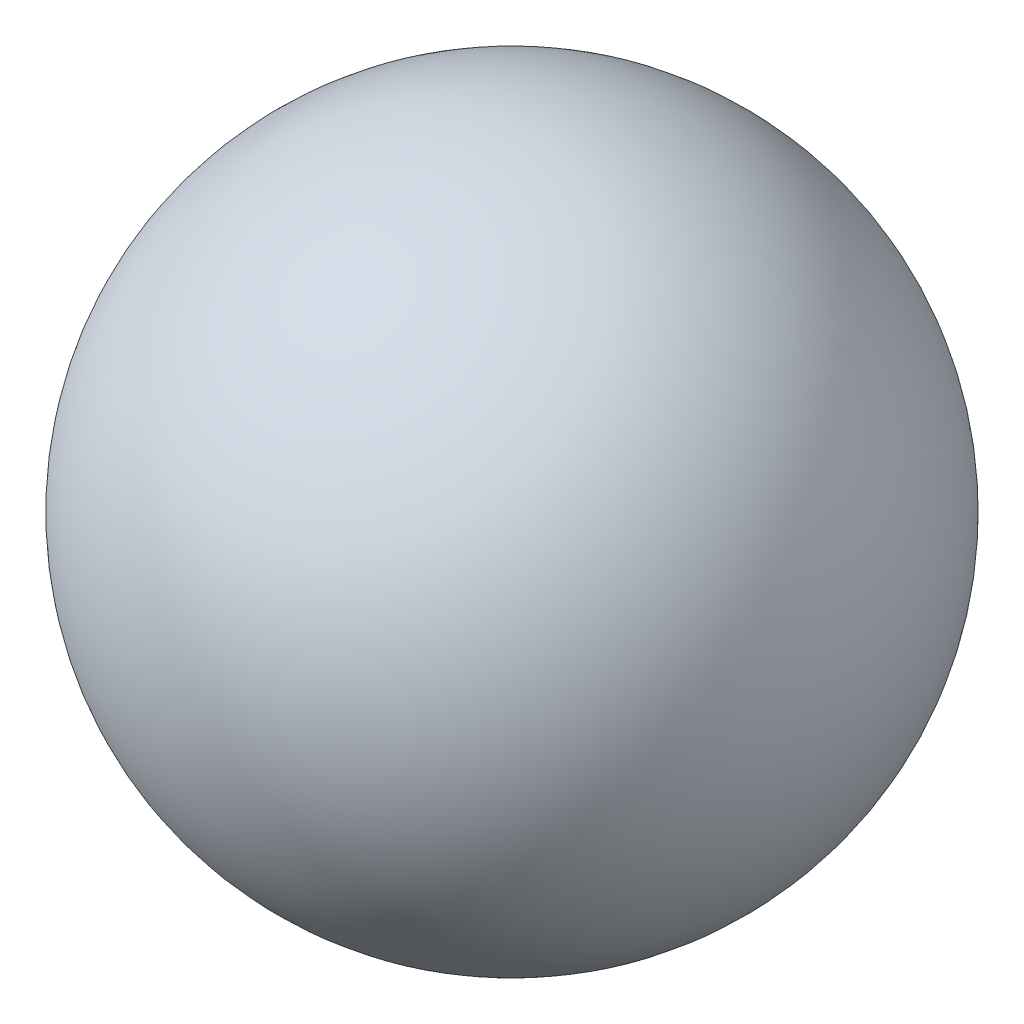
ISO-10303-21;
HEADER;
FILE_DESCRIPTION(('STEP AP214'),'2;1');
FILE_NAME('part.step','',(''),(''),'','','');
FILE_SCHEMA(('AUTOMOTIVE_DESIGN { 1 0 10303 214 1 1 1 1 }'));
ENDSEC;
DATA;
#1=APPLICATION_CONTEXT('core data for automotive mechanical design processes');
#2=APPLICATION_PROTOCOL_DEFINITION('international standard','automotive_design',2000,#1);
#3=PRODUCT_CONTEXT('',#1,'mechanical');
#4=PRODUCT('Part','Part','',(#3));
#5=PRODUCT_RELATED_PRODUCT_CATEGORY('part','',(#4));
#6=PRODUCT_DEFINITION_FORMATION('','',#4);
#7=PRODUCT_DEFINITION_CONTEXT('part definition',#1,'design');
#8=PRODUCT_DEFINITION('design','',#6,#7);
#9=PRODUCT_DEFINITION_SHAPE('','',#8);
#10=(LENGTH_UNIT() NAMED_UNIT(*) SI_UNIT(.MILLI.,.METRE.));
#11=(NAMED_UNIT(*) PLANE_ANGLE_UNIT() SI_UNIT($,.RADIAN.));
#12=(NAMED_UNIT(*) SI_UNIT($,.STERADIAN.) SOLID_ANGLE_UNIT());
#13=UNCERTAINTY_MEASURE_WITH_UNIT(LENGTH_MEASURE(1.E-05),#10,'distance_accuracy_value','');
#14=(GEOMETRIC_REPRESENTATION_CONTEXT(3) GLOBAL_UNCERTAINTY_ASSIGNED_CONTEXT((#13)) GLOBAL_UNIT_ASSIGNED_CONTEXT((#10,
#11,#12)) REPRESENTATION_CONTEXT('',''));
#15=CARTESIAN_POINT('',(0.,0.,0.));
#16=DIRECTION('',(0.,0.,1.));
#17=DIRECTION('',(1.,0.,0.));
#18=AXIS2_PLACEMENT_3D('',#15,#16,#17);
#19=CARTESIAN_POINT('',(0.,4.,0.));
#20=DIRECTION('',(0.,-1.,0.));
#21=DIRECTION('',(-1.,0.,0.));
#22=AXIS2_PLACEMENT_3D('',#19,#20,#21);
#23=SPHERICAL_SURFACE('',#22,4.);
#24=CARTESIAN_POINT('',(0.,0.,0.));
#25=VERTEX_POINT('',#24);
#26=VERTEX_LOOP('',#25);
#27=FACE_BOUND('',#26,.T.);
#28=ADVANCED_FACE('F26',(#27),#23,.T.);
#29=CLOSED_SHELL('',(#28));
#30=MANIFOLD_SOLID_BREP('B2',#29);
#31=ADVANCED_BREP_SHAPE_REPRESENTATION('',(#18,#30),#14);
#32=SHAPE_DEFINITION_REPRESENTATION(#9,#31);
ENDSEC;
END-ISO-10303-21;
